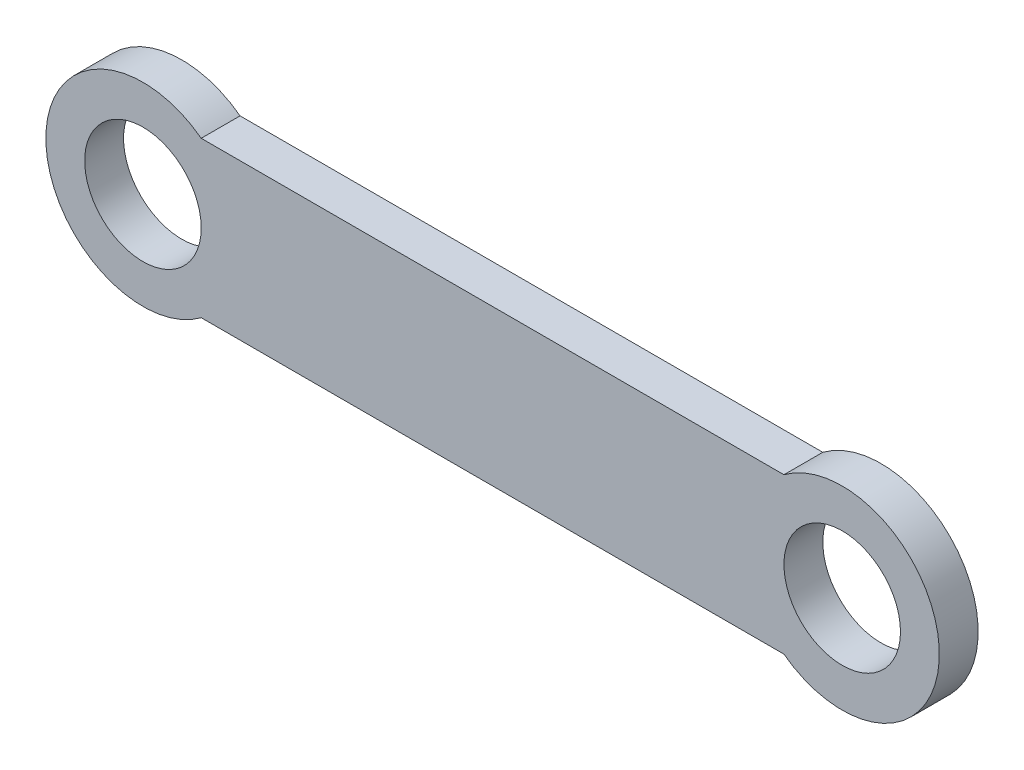
ISO-10303-21;
HEADER;
FILE_DESCRIPTION(('STEP AP214'),'2;1');
FILE_NAME('part.step','',(''),(''),'','','');
FILE_SCHEMA(('AUTOMOTIVE_DESIGN { 1 0 10303 214 1 1 1 1 }'));
ENDSEC;
DATA;
#1=APPLICATION_CONTEXT('core data for automotive mechanical design processes');
#2=APPLICATION_PROTOCOL_DEFINITION('international standard','automotive_design',2000,#1);
#3=PRODUCT_CONTEXT('',#1,'mechanical');
#4=PRODUCT('Part','Part','',(#3));
#5=PRODUCT_RELATED_PRODUCT_CATEGORY('part','',(#4));
#6=PRODUCT_DEFINITION_FORMATION('','',#4);
#7=PRODUCT_DEFINITION_CONTEXT('part definition',#1,'design');
#8=PRODUCT_DEFINITION('design','',#6,#7);
#9=PRODUCT_DEFINITION_SHAPE('','',#8);
#10=(LENGTH_UNIT() NAMED_UNIT(*) SI_UNIT(.MILLI.,.METRE.));
#11=(NAMED_UNIT(*) PLANE_ANGLE_UNIT() SI_UNIT($,.RADIAN.));
#12=(NAMED_UNIT(*) SI_UNIT($,.STERADIAN.) SOLID_ANGLE_UNIT());
#13=UNCERTAINTY_MEASURE_WITH_UNIT(LENGTH_MEASURE(1.E-05),#10,'distance_accuracy_value','');
#14=(GEOMETRIC_REPRESENTATION_CONTEXT(3) GLOBAL_UNCERTAINTY_ASSIGNED_CONTEXT((#13)) GLOBAL_UNIT_ASSIGNED_CONTEXT((#10,
#11,#12)) REPRESENTATION_CONTEXT('',''));
#15=CARTESIAN_POINT('',(0.,0.,0.));
#16=DIRECTION('',(0.,0.,1.));
#17=DIRECTION('',(1.,0.,0.));
#18=AXIS2_PLACEMENT_3D('',#15,#16,#17);
#19=CARTESIAN_POINT('',(-31.4355779522624,-1.5,1.));
#20=DIRECTION('',(0.,0.,1.));
#21=DIRECTION('',(1.,0.,0.));
#22=AXIS2_PLACEMENT_3D('',#19,#20,#21);
#23=PLANE('',#22);
#24=CARTESIAN_POINT('',(-31.4355779522624,-1.5,1.));
#25=DIRECTION('',(0.,0.,1.));
#26=DIRECTION('',(1.,0.,0.));
#27=AXIS2_PLACEMENT_3D('',#24,#25,#26);
#28=CIRCLE('',#27,1.5);
#29=CARTESIAN_POINT('',(-29.9355779522624,-1.5,1.));
#30=VERTEX_POINT('',#29);
#31=EDGE_CURVE('E98',#30,#30,#28,.T.);
#32=ORIENTED_EDGE('',*,*,#31,.F.);
#33=EDGE_LOOP('',(#32));
#34=FACE_BOUND('',#33,.T.);
#35=CARTESIAN_POINT('',(-31.4355779522624,-1.5,1.));
#36=DIRECTION('',(0.,0.,1.));
#37=DIRECTION('',(1.,0.,0.));
#38=AXIS2_PLACEMENT_3D('',#35,#36,#37);
#39=CIRCLE('',#38,2.5);
#40=CARTESIAN_POINT('',(-29.9355779522624,0.500000000000001,1.));
#41=VERTEX_POINT('',#40);
#42=CARTESIAN_POINT('',(-29.9355779522624,-3.5,1.));
#43=VERTEX_POINT('',#42);
#44=EDGE_CURVE('E83',#41,#43,#39,.T.);
#45=ORIENTED_EDGE('',*,*,#44,.T.);
#46=DIRECTION('',(1.,0.,0.));
#47=VECTOR('',#46,1.);
#48=CARTESIAN_POINT('',(-29.9355779522624,-3.5,1.));
#49=LINE('',#48,#47);
#50=CARTESIAN_POINT('',(-14.9355779522624,-3.5,1.));
#51=VERTEX_POINT('',#50);
#52=EDGE_CURVE('E78',#43,#51,#49,.T.);
#53=ORIENTED_EDGE('',*,*,#52,.T.);
#54=CARTESIAN_POINT('',(-13.4355779522624,-1.5,1.));
#55=DIRECTION('',(0.,0.,1.));
#56=DIRECTION('',(1.,0.,0.));
#57=AXIS2_PLACEMENT_3D('',#54,#55,#56);
#58=CIRCLE('',#57,2.5);
#59=CARTESIAN_POINT('',(-14.9355779522624,0.5,1.));
#60=VERTEX_POINT('',#59);
#61=EDGE_CURVE('E81',#51,#60,#58,.T.);
#62=ORIENTED_EDGE('',*,*,#61,.T.);
#63=DIRECTION('',(-1.,0.,0.));
#64=VECTOR('',#63,1.);
#65=CARTESIAN_POINT('',(-29.9355779522624,0.500000000000001,1.));
#66=LINE('',#65,#64);
#67=EDGE_CURVE('E48',#60,#41,#66,.T.);
#68=ORIENTED_EDGE('',*,*,#67,.T.);
#69=EDGE_LOOP('',(#45,#53,#62,#68));
#70=FACE_BOUND('',#69,.T.);
#71=CARTESIAN_POINT('',(-13.4355779522624,-1.5,1.));
#72=DIRECTION('',(0.,0.,1.));
#73=DIRECTION('',(1.,0.,0.));
#74=AXIS2_PLACEMENT_3D('',#71,#72,#73);
#75=CIRCLE('',#74,1.5);
#76=CARTESIAN_POINT('',(-11.9355779522624,-1.5,1.));
#77=VERTEX_POINT('',#76);
#78=EDGE_CURVE('E113',#77,#77,#75,.T.);
#79=ORIENTED_EDGE('',*,*,#78,.F.);
#80=EDGE_LOOP('',(#79));
#81=FACE_BOUND('',#80,.T.);
#82=ADVANCED_FACE('F31',(#34,#70,#81),#23,.T.);
#83=CARTESIAN_POINT('',(-31.4355779522624,-1.5,0.));
#84=DIRECTION('',(0.,0.,1.));
#85=DIRECTION('',(1.,0.,0.));
#86=AXIS2_PLACEMENT_3D('',#83,#84,#85);
#87=PLANE('',#86);
#88=CARTESIAN_POINT('',(-31.4355779522624,-1.5,0.));
#89=DIRECTION('',(0.,0.,1.));
#90=DIRECTION('',(1.,0.,0.));
#91=AXIS2_PLACEMENT_3D('',#88,#89,#90);
#92=CIRCLE('',#91,1.5);
#93=CARTESIAN_POINT('',(-29.9355779522624,-1.5,0.));
#94=VERTEX_POINT('',#93);
#95=EDGE_CURVE('E110',#94,#94,#92,.T.);
#96=ORIENTED_EDGE('',*,*,#95,.T.);
#97=EDGE_LOOP('',(#96));
#98=FACE_BOUND('',#97,.T.);
#99=CARTESIAN_POINT('',(-31.4355779522624,-1.5,0.));
#100=DIRECTION('',(0.,0.,1.));
#101=DIRECTION('',(1.,0.,0.));
#102=AXIS2_PLACEMENT_3D('',#99,#100,#101);
#103=CIRCLE('',#102,2.5);
#104=CARTESIAN_POINT('',(-29.9355779522624,0.500000000000001,0.));
#105=VERTEX_POINT('',#104);
#106=CARTESIAN_POINT('',(-29.9355779522624,-3.5,0.));
#107=VERTEX_POINT('',#106);
#108=EDGE_CURVE('E95',#105,#107,#103,.T.);
#109=ORIENTED_EDGE('',*,*,#108,.F.);
#110=DIRECTION('',(-1.,0.,0.));
#111=VECTOR('',#110,1.);
#112=CARTESIAN_POINT('',(-29.9355779522624,0.500000000000001,0.));
#113=LINE('',#112,#111);
#114=CARTESIAN_POINT('',(-14.9355779522624,0.5,0.));
#115=VERTEX_POINT('',#114);
#116=EDGE_CURVE('E71',#115,#105,#113,.T.);
#117=ORIENTED_EDGE('',*,*,#116,.F.);
#118=CARTESIAN_POINT('',(-13.4355779522624,-1.5,0.));
#119=DIRECTION('',(0.,0.,1.));
#120=DIRECTION('',(1.,0.,0.));
#121=AXIS2_PLACEMENT_3D('',#118,#119,#120);
#122=CIRCLE('',#121,2.5);
#123=CARTESIAN_POINT('',(-14.9355779522624,-3.5,0.));
#124=VERTEX_POINT('',#123);
#125=EDGE_CURVE('E65',#124,#115,#122,.T.);
#126=ORIENTED_EDGE('',*,*,#125,.F.);
#127=DIRECTION('',(1.,0.,0.));
#128=VECTOR('',#127,1.);
#129=CARTESIAN_POINT('',(-29.9355779522624,-3.5,0.));
#130=LINE('',#129,#128);
#131=EDGE_CURVE('E87',#107,#124,#130,.T.);
#132=ORIENTED_EDGE('',*,*,#131,.F.);
#133=EDGE_LOOP('',(#109,#117,#126,#132));
#134=FACE_BOUND('',#133,.T.);
#135=CARTESIAN_POINT('',(-13.4355779522624,-1.5,0.));
#136=DIRECTION('',(0.,0.,1.));
#137=DIRECTION('',(1.,0.,0.));
#138=AXIS2_PLACEMENT_3D('',#135,#136,#137);
#139=CIRCLE('',#138,1.5);
#140=CARTESIAN_POINT('',(-11.9355779522624,-1.5,0.));
#141=VERTEX_POINT('',#140);
#142=EDGE_CURVE('E116',#141,#141,#139,.T.);
#143=ORIENTED_EDGE('',*,*,#142,.T.);
#144=EDGE_LOOP('',(#143));
#145=FACE_BOUND('',#144,.T.);
#146=ADVANCED_FACE('F106',(#98,#134,#145),#87,.F.);
#147=CARTESIAN_POINT('',(-31.4355779522624,-1.5,1.));
#148=DIRECTION('',(0.,0.,-1.));
#149=DIRECTION('',(-1.,0.,0.));
#150=AXIS2_PLACEMENT_3D('',#147,#148,#149);
#151=CYLINDRICAL_SURFACE('',#150,2.5);
#152=ORIENTED_EDGE('',*,*,#108,.T.);
#153=DIRECTION('',(0.,0.,-1.));
#154=VECTOR('',#153,1.);
#155=CARTESIAN_POINT('',(-29.9355779522624,-3.5,1.));
#156=LINE('',#155,#154);
#157=EDGE_CURVE('E11',#43,#107,#156,.T.);
#158=ORIENTED_EDGE('',*,*,#157,.F.);
#159=ORIENTED_EDGE('',*,*,#44,.F.);
#160=DIRECTION('',(0.,0.,-1.));
#161=VECTOR('',#160,1.);
#162=CARTESIAN_POINT('',(-29.9355779522624,0.500000000000001,1.));
#163=LINE('',#162,#161);
#164=EDGE_CURVE('E91',#41,#105,#163,.T.);
#165=ORIENTED_EDGE('',*,*,#164,.T.);
#166=EDGE_LOOP('',(#152,#158,#159,#165));
#167=FACE_BOUND('',#166,.T.);
#168=ADVANCED_FACE('F33',(#167),#151,.T.);
#169=CARTESIAN_POINT('',(-29.9355779522624,-3.5,1.));
#170=DIRECTION('',(0.,1.,0.));
#171=DIRECTION('',(0.,0.,1.));
#172=AXIS2_PLACEMENT_3D('',#169,#170,#171);
#173=PLANE('',#172);
#174=ORIENTED_EDGE('',*,*,#131,.T.);
#175=DIRECTION('',(0.,0.,-1.));
#176=VECTOR('',#175,1.);
#177=CARTESIAN_POINT('',(-14.9355779522624,-3.5,1.));
#178=LINE('',#177,#176);
#179=EDGE_CURVE('E40',#51,#124,#178,.T.);
#180=ORIENTED_EDGE('',*,*,#179,.F.);
#181=ORIENTED_EDGE('',*,*,#52,.F.);
#182=ORIENTED_EDGE('',*,*,#157,.T.);
#183=EDGE_LOOP('',(#174,#180,#181,#182));
#184=FACE_BOUND('',#183,.T.);
#185=ADVANCED_FACE('F86',(#184),#173,.F.);
#186=CARTESIAN_POINT('',(-13.4355779522624,-1.5,1.));
#187=DIRECTION('',(0.,0.,-1.));
#188=DIRECTION('',(-1.,0.,0.));
#189=AXIS2_PLACEMENT_3D('',#186,#187,#188);
#190=CYLINDRICAL_SURFACE('',#189,2.5);
#191=ORIENTED_EDGE('',*,*,#125,.T.);
#192=DIRECTION('',(0.,0.,-1.));
#193=VECTOR('',#192,1.);
#194=CARTESIAN_POINT('',(-14.9355779522624,0.5,1.));
#195=LINE('',#194,#193);
#196=EDGE_CURVE('E88',#60,#115,#195,.T.);
#197=ORIENTED_EDGE('',*,*,#196,.F.);
#198=ORIENTED_EDGE('',*,*,#61,.F.);
#199=ORIENTED_EDGE('',*,*,#179,.T.);
#200=EDGE_LOOP('',(#191,#197,#198,#199));
#201=FACE_BOUND('',#200,.T.);
#202=ADVANCED_FACE('F89',(#201),#190,.T.);
#203=CARTESIAN_POINT('',(-29.9355779522624,0.500000000000001,1.));
#204=DIRECTION('',(0.,-1.,0.));
#205=DIRECTION('',(1.,0.,0.));
#206=AXIS2_PLACEMENT_3D('',#203,#204,#205);
#207=PLANE('',#206);
#208=ORIENTED_EDGE('',*,*,#116,.T.);
#209=ORIENTED_EDGE('',*,*,#164,.F.);
#210=ORIENTED_EDGE('',*,*,#67,.F.);
#211=ORIENTED_EDGE('',*,*,#196,.T.);
#212=EDGE_LOOP('',(#208,#209,#210,#211));
#213=FACE_BOUND('',#212,.T.);
#214=ADVANCED_FACE('F103',(#213),#207,.F.);
#215=CARTESIAN_POINT('',(-31.4355779522624,-1.5,1.));
#216=DIRECTION('',(0.,0.,-1.));
#217=DIRECTION('',(-1.,0.,0.));
#218=AXIS2_PLACEMENT_3D('',#215,#216,#217);
#219=CYLINDRICAL_SURFACE('',#218,1.5);
#220=ORIENTED_EDGE('',*,*,#31,.T.);
#221=EDGE_LOOP('',(#220));
#222=FACE_BOUND('',#221,.T.);
#223=ORIENTED_EDGE('',*,*,#95,.F.);
#224=EDGE_LOOP('',(#223));
#225=FACE_BOUND('',#224,.T.);
#226=ADVANCED_FACE('F134',(#222,#225),#219,.F.);
#227=CARTESIAN_POINT('',(-13.4355779522624,-1.5,1.));
#228=DIRECTION('',(0.,0.,-1.));
#229=DIRECTION('',(-1.,0.,0.));
#230=AXIS2_PLACEMENT_3D('',#227,#228,#229);
#231=CYLINDRICAL_SURFACE('',#230,1.5);
#232=ORIENTED_EDGE('',*,*,#78,.T.);
#233=EDGE_LOOP('',(#232));
#234=FACE_BOUND('',#233,.T.);
#235=ORIENTED_EDGE('',*,*,#142,.F.);
#236=EDGE_LOOP('',(#235));
#237=FACE_BOUND('',#236,.T.);
#238=ADVANCED_FACE('F122',(#234,#237),#231,.F.);
#239=CLOSED_SHELL('',(#82,#146,#168,#185,#202,#214,#226,#238));
#240=MANIFOLD_SOLID_BREP('B2',#239);
#241=ADVANCED_BREP_SHAPE_REPRESENTATION('',(#18,#240),#14);
#242=SHAPE_DEFINITION_REPRESENTATION(#9,#241);
ENDSEC;
END-ISO-10303-21;
